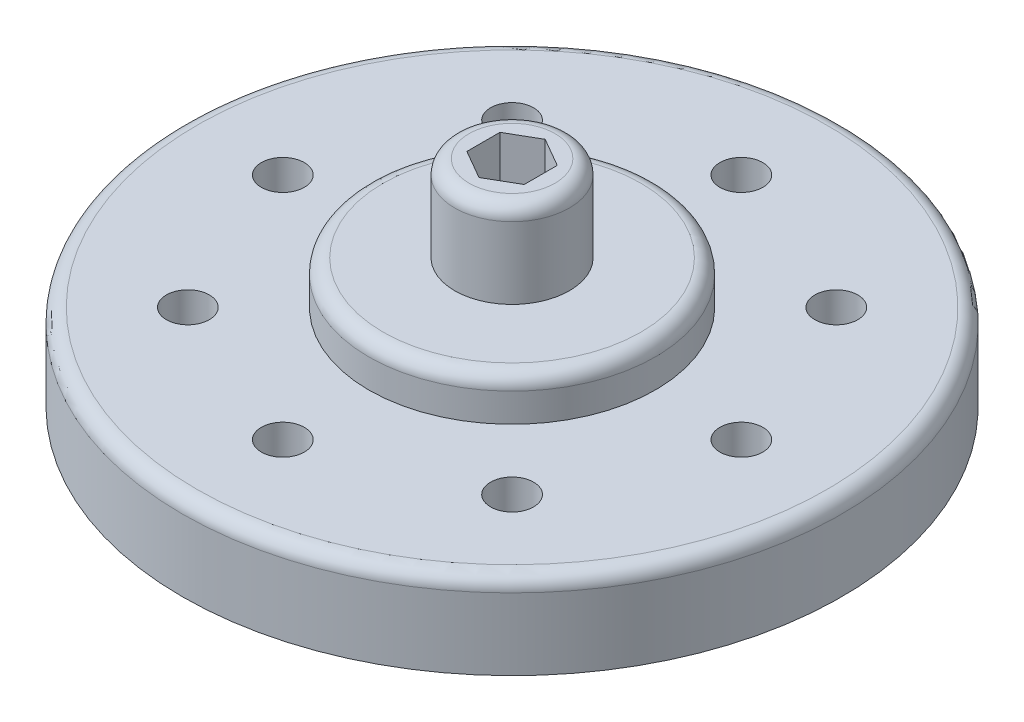
ISO-10303-21;
HEADER;
FILE_DESCRIPTION(('STEP AP214'),'2;1');
FILE_NAME('part.step','',(''),(''),'','','');
FILE_SCHEMA(('AUTOMOTIVE_DESIGN { 1 0 10303 214 1 1 1 1 }'));
ENDSEC;
DATA;
#1=APPLICATION_CONTEXT('core data for automotive mechanical design processes');
#2=APPLICATION_PROTOCOL_DEFINITION('international standard','automotive_design',2000,#1);
#3=PRODUCT_CONTEXT('',#1,'mechanical');
#4=PRODUCT('Part','Part','',(#3));
#5=PRODUCT_RELATED_PRODUCT_CATEGORY('part','',(#4));
#6=PRODUCT_DEFINITION_FORMATION('','',#4);
#7=PRODUCT_DEFINITION_CONTEXT('part definition',#1,'design');
#8=PRODUCT_DEFINITION('design','',#6,#7);
#9=PRODUCT_DEFINITION_SHAPE('','',#8);
#10=(LENGTH_UNIT() NAMED_UNIT(*) SI_UNIT(.MILLI.,.METRE.));
#11=(NAMED_UNIT(*) PLANE_ANGLE_UNIT() SI_UNIT($,.RADIAN.));
#12=(NAMED_UNIT(*) SI_UNIT($,.STERADIAN.) SOLID_ANGLE_UNIT());
#13=UNCERTAINTY_MEASURE_WITH_UNIT(LENGTH_MEASURE(1.E-05),#10,'distance_accuracy_value','');
#14=(GEOMETRIC_REPRESENTATION_CONTEXT(3) GLOBAL_UNCERTAINTY_ASSIGNED_CONTEXT((#13)) GLOBAL_UNIT_ASSIGNED_CONTEXT((#10,
#11,#12)) REPRESENTATION_CONTEXT('',''));
#15=CARTESIAN_POINT('',(0.,0.,0.));
#16=DIRECTION('',(0.,0.,1.));
#17=DIRECTION('',(1.,0.,0.));
#18=AXIS2_PLACEMENT_3D('',#15,#16,#17);
#19=CARTESIAN_POINT('',(0.,4.5,-13.3));
#20=DIRECTION('',(0.,1.,0.));
#21=DIRECTION('',(0.,0.,1.));
#22=AXIS2_PLACEMENT_3D('',#19,#20,#21);
#23=PLANE('',#22);
#24=CARTESIAN_POINT('',(0.,4.5,-13.3));
#25=DIRECTION('',(0.,1.,0.));
#26=DIRECTION('',(0.,0.,1.));
#27=AXIS2_PLACEMENT_3D('',#24,#25,#26);
#28=CIRCLE('',#27,4.5);
#29=CARTESIAN_POINT('',(0.,4.5,-8.79999999999999));
#30=VERTEX_POINT('',#29);
#31=EDGE_CURVE('E226',#30,#30,#28,.T.);
#32=ORIENTED_EDGE('',*,*,#31,.T.);
#33=EDGE_LOOP('',(#32));
#34=FACE_BOUND('',#33,.T.);
#35=CARTESIAN_POINT('',(0.,4.5,-13.3));
#36=DIRECTION('',(0.,1.,0.));
#37=DIRECTION('',(0.,0.,1.));
#38=AXIS2_PLACEMENT_3D('',#35,#36,#37);
#39=CIRCLE('',#38,2.);
#40=CARTESIAN_POINT('',(0.,4.5,-11.3));
#41=VERTEX_POINT('',#40);
#42=EDGE_CURVE('E156',#41,#41,#39,.T.);
#43=ORIENTED_EDGE('',*,*,#42,.F.);
#44=EDGE_LOOP('',(#43));
#45=FACE_BOUND('',#44,.T.);
#46=ADVANCED_FACE('F55',(#34,#45),#23,.T.);
#47=CARTESIAN_POINT('',(0.,3.,-13.3));
#48=DIRECTION('',(0.,1.,0.));
#49=DIRECTION('',(0.,0.,1.));
#50=AXIS2_PLACEMENT_3D('',#47,#48,#49);
#51=PLANE('',#50);
#52=CARTESIAN_POINT('',(0.,3.,-13.3));
#53=DIRECTION('',(0.,1.,0.));
#54=DIRECTION('',(0.,0.,1.));
#55=AXIS2_PLACEMENT_3D('',#52,#53,#54);
#56=CIRCLE('',#55,11.);
#57=CARTESIAN_POINT('',(0.,3.,-2.3));
#58=VERTEX_POINT('',#57);
#59=EDGE_CURVE('E232',#58,#58,#56,.T.);
#60=ORIENTED_EDGE('',*,*,#59,.T.);
#61=EDGE_LOOP('',(#60));
#62=FACE_BOUND('',#61,.T.);
#63=CARTESIAN_POINT('',(5.65685424949231,3.,-18.9568542494924));
#64=DIRECTION('',(0.,1.,0.));
#65=DIRECTION('',(-0.707106781186539,0.,0.707106781186556));
#66=AXIS2_PLACEMENT_3D('',#63,#64,#65);
#67=CIRCLE('',#66,0.750000000000001);
#68=CARTESIAN_POINT('',(5.1265241636024,3.,-18.4265241636025));
#69=VERTEX_POINT('',#68);
#70=EDGE_CURVE('E170',#69,#69,#67,.T.);
#71=ORIENTED_EDGE('',*,*,#70,.F.);
#72=EDGE_LOOP('',(#71));
#73=FACE_BOUND('',#72,.T.);
#74=CARTESIAN_POINT('',(5.65685424949243,3.,-7.64314575050767));
#75=DIRECTION('',(0.,1.,0.));
#76=DIRECTION('',(-0.707106781186554,0.,-0.707106781186541));
#77=AXIS2_PLACEMENT_3D('',#74,#75,#76);
#78=CIRCLE('',#77,0.750000000000001);
#79=CARTESIAN_POINT('',(5.12652416360252,3.,-8.17347583639758));
#80=VERTEX_POINT('',#79);
#81=EDGE_CURVE('E182',#80,#80,#78,.T.);
#82=ORIENTED_EDGE('',*,*,#81,.F.);
#83=EDGE_LOOP('',(#82));
#84=FACE_BOUND('',#83,.T.);
#85=CARTESIAN_POINT('',(-5.65685424949234,3.,-7.64314575050758));
#86=DIRECTION('',(0.,1.,0.));
#87=DIRECTION('',(0.707106781186544,0.,-0.707106781186551));
#88=AXIS2_PLACEMENT_3D('',#85,#86,#87);
#89=CIRCLE('',#88,0.750000000000001);
#90=CARTESIAN_POINT('',(-5.12652416360244,3.,-8.1734758363975));
#91=VERTEX_POINT('',#90);
#92=EDGE_CURVE('E194',#91,#91,#89,.T.);
#93=ORIENTED_EDGE('',*,*,#92,.F.);
#94=EDGE_LOOP('',(#93));
#95=FACE_BOUND('',#94,.T.);
#96=CARTESIAN_POINT('',(-5.65685424949239,3.,-18.9568542494924));
#97=DIRECTION('',(0.,1.,0.));
#98=DIRECTION('',(0.707106781186549,0.,0.707106781186546));
#99=AXIS2_PLACEMENT_3D('',#96,#97,#98);
#100=CIRCLE('',#99,0.750000000000001);
#101=CARTESIAN_POINT('',(-5.12652416360248,3.,-18.4265241636025));
#102=VERTEX_POINT('',#101);
#103=EDGE_CURVE('E206',#102,#102,#100,.T.);
#104=ORIENTED_EDGE('',*,*,#103,.F.);
#105=EDGE_LOOP('',(#104));
#106=FACE_BOUND('',#105,.T.);
#107=CARTESIAN_POINT('',(0.,3.,-21.3));
#108=DIRECTION('',(0.,1.,0.));
#109=DIRECTION('',(0.,0.,1.));
#110=AXIS2_PLACEMENT_3D('',#107,#108,#109);
#111=CIRCLE('',#110,0.750000000000001);
#112=CARTESIAN_POINT('',(0.,3.,-20.55));
#113=VERTEX_POINT('',#112);
#114=EDGE_CURVE('E212',#113,#113,#111,.T.);
#115=ORIENTED_EDGE('',*,*,#114,.F.);
#116=EDGE_LOOP('',(#115));
#117=FACE_BOUND('',#116,.T.);
#118=CARTESIAN_POINT('',(-7.99999999999999,3.,-13.3));
#119=DIRECTION('',(0.,1.,0.));
#120=DIRECTION('',(1.,0.,0.));
#121=AXIS2_PLACEMENT_3D('',#118,#119,#120);
#122=CIRCLE('',#121,0.750000000000001);
#123=CARTESIAN_POINT('',(-7.24999999999999,3.,-13.3));
#124=VERTEX_POINT('',#123);
#125=EDGE_CURVE('E200',#124,#124,#122,.T.);
#126=ORIENTED_EDGE('',*,*,#125,.F.);
#127=EDGE_LOOP('',(#126));
#128=FACE_BOUND('',#127,.T.);
#129=CARTESIAN_POINT('',(0.,3.,-5.3));
#130=DIRECTION('',(0.,1.,0.));
#131=DIRECTION('',(0.,0.,-1.));
#132=AXIS2_PLACEMENT_3D('',#129,#130,#131);
#133=CIRCLE('',#132,0.750000000000001);
#134=CARTESIAN_POINT('',(0.,3.,-6.05));
#135=VERTEX_POINT('',#134);
#136=EDGE_CURVE('E188',#135,#135,#133,.T.);
#137=ORIENTED_EDGE('',*,*,#136,.F.);
#138=EDGE_LOOP('',(#137));
#139=FACE_BOUND('',#138,.T.);
#140=CARTESIAN_POINT('',(8.,3.,-13.3000000000001));
#141=DIRECTION('',(0.,1.,0.));
#142=DIRECTION('',(-1.,0.,0.));
#143=AXIS2_PLACEMENT_3D('',#140,#141,#142);
#144=CIRCLE('',#143,0.750000000000001);
#145=CARTESIAN_POINT('',(7.25,3.,-13.3000000000001));
#146=VERTEX_POINT('',#145);
#147=EDGE_CURVE('E176',#146,#146,#144,.T.);
#148=ORIENTED_EDGE('',*,*,#147,.F.);
#149=EDGE_LOOP('',(#148));
#150=FACE_BOUND('',#149,.T.);
#151=CARTESIAN_POINT('',(0.,3.,-13.3));
#152=DIRECTION('',(0.,1.,0.));
#153=DIRECTION('',(0.,0.,1.));
#154=AXIS2_PLACEMENT_3D('',#151,#152,#153);
#155=CIRCLE('',#154,5.);
#156=CARTESIAN_POINT('',(0.,3.,-8.29999999999999));
#157=VERTEX_POINT('',#156);
#158=EDGE_CURVE('E166',#157,#157,#155,.T.);
#159=ORIENTED_EDGE('',*,*,#158,.F.);
#160=EDGE_LOOP('',(#159));
#161=FACE_BOUND('',#160,.T.);
#162=ADVANCED_FACE('F246',(#62,#73,#84,#95,#106,#117,#128,#139,#150,#161),#51,.T.);
#163=CARTESIAN_POINT('',(0.,0.,-13.3));
#164=DIRECTION('',(0.,1.,0.));
#165=DIRECTION('',(0.,0.,1.));
#166=AXIS2_PLACEMENT_3D('',#163,#164,#165);
#167=PLANE('',#166);
#168=CARTESIAN_POINT('',(0.,0.,-13.3));
#169=DIRECTION('',(0.,1.,0.));
#170=DIRECTION('',(0.,0.,1.));
#171=AXIS2_PLACEMENT_3D('',#168,#169,#170);
#172=CIRCLE('',#171,5.);
#173=CARTESIAN_POINT('',(0.,0.,-8.29999999999999));
#174=VERTEX_POINT('',#173);
#175=EDGE_CURVE('E132',#174,#174,#172,.T.);
#176=ORIENTED_EDGE('',*,*,#175,.T.);
#177=EDGE_LOOP('',(#176));
#178=FACE_BOUND('',#177,.T.);
#179=CARTESIAN_POINT('',(0.,0.,-13.3));
#180=DIRECTION('',(0.,1.,0.));
#181=DIRECTION('',(0.,0.,1.));
#182=AXIS2_PLACEMENT_3D('',#179,#180,#181);
#183=CIRCLE('',#182,11.5);
#184=CARTESIAN_POINT('',(0.,0.,-1.8));
#185=VERTEX_POINT('',#184);
#186=EDGE_CURVE('E215',#185,#185,#183,.T.);
#187=ORIENTED_EDGE('',*,*,#186,.F.);
#188=EDGE_LOOP('',(#187));
#189=FACE_BOUND('',#188,.T.);
#190=CARTESIAN_POINT('',(0.,0.,-21.3));
#191=DIRECTION('',(0.,1.,0.));
#192=DIRECTION('',(0.,0.,1.));
#193=AXIS2_PLACEMENT_3D('',#190,#191,#192);
#194=CIRCLE('',#193,0.750000000000001);
#195=CARTESIAN_POINT('',(0.,0.,-20.55));
#196=VERTEX_POINT('',#195);
#197=EDGE_CURVE('E209',#196,#196,#194,.T.);
#198=ORIENTED_EDGE('',*,*,#197,.T.);
#199=EDGE_LOOP('',(#198));
#200=FACE_BOUND('',#199,.T.);
#201=CARTESIAN_POINT('',(-5.65685424949239,0.,-18.9568542494924));
#202=DIRECTION('',(0.,1.,0.));
#203=DIRECTION('',(0.707106781186549,0.,0.707106781186546));
#204=AXIS2_PLACEMENT_3D('',#201,#202,#203);
#205=CIRCLE('',#204,0.750000000000001);
#206=CARTESIAN_POINT('',(-5.12652416360248,0.,-18.4265241636025));
#207=VERTEX_POINT('',#206);
#208=EDGE_CURVE('E203',#207,#207,#205,.T.);
#209=ORIENTED_EDGE('',*,*,#208,.T.);
#210=EDGE_LOOP('',(#209));
#211=FACE_BOUND('',#210,.T.);
#212=CARTESIAN_POINT('',(-7.99999999999999,0.,-13.3));
#213=DIRECTION('',(0.,1.,0.));
#214=DIRECTION('',(1.,0.,0.));
#215=AXIS2_PLACEMENT_3D('',#212,#213,#214);
#216=CIRCLE('',#215,0.750000000000001);
#217=CARTESIAN_POINT('',(-7.24999999999999,0.,-13.3));
#218=VERTEX_POINT('',#217);
#219=EDGE_CURVE('E197',#218,#218,#216,.T.);
#220=ORIENTED_EDGE('',*,*,#219,.T.);
#221=EDGE_LOOP('',(#220));
#222=FACE_BOUND('',#221,.T.);
#223=CARTESIAN_POINT('',(-5.65685424949234,0.,-7.64314575050758));
#224=DIRECTION('',(0.,1.,0.));
#225=DIRECTION('',(0.707106781186544,0.,-0.707106781186551));
#226=AXIS2_PLACEMENT_3D('',#223,#224,#225);
#227=CIRCLE('',#226,0.750000000000001);
#228=CARTESIAN_POINT('',(-5.12652416360244,0.,-8.1734758363975));
#229=VERTEX_POINT('',#228);
#230=EDGE_CURVE('E191',#229,#229,#227,.T.);
#231=ORIENTED_EDGE('',*,*,#230,.T.);
#232=EDGE_LOOP('',(#231));
#233=FACE_BOUND('',#232,.T.);
#234=CARTESIAN_POINT('',(0.,0.,-5.3));
#235=DIRECTION('',(0.,1.,0.));
#236=DIRECTION('',(0.,0.,-1.));
#237=AXIS2_PLACEMENT_3D('',#234,#235,#236);
#238=CIRCLE('',#237,0.750000000000001);
#239=CARTESIAN_POINT('',(0.,0.,-6.05));
#240=VERTEX_POINT('',#239);
#241=EDGE_CURVE('E185',#240,#240,#238,.T.);
#242=ORIENTED_EDGE('',*,*,#241,.T.);
#243=EDGE_LOOP('',(#242));
#244=FACE_BOUND('',#243,.T.);
#245=CARTESIAN_POINT('',(5.65685424949243,0.,-7.64314575050767));
#246=DIRECTION('',(0.,1.,0.));
#247=DIRECTION('',(-0.707106781186554,0.,-0.707106781186541));
#248=AXIS2_PLACEMENT_3D('',#245,#246,#247);
#249=CIRCLE('',#248,0.750000000000001);
#250=CARTESIAN_POINT('',(5.12652416360252,0.,-8.17347583639758));
#251=VERTEX_POINT('',#250);
#252=EDGE_CURVE('E179',#251,#251,#249,.T.);
#253=ORIENTED_EDGE('',*,*,#252,.T.);
#254=EDGE_LOOP('',(#253));
#255=FACE_BOUND('',#254,.T.);
#256=CARTESIAN_POINT('',(8.,0.,-13.3000000000001));
#257=DIRECTION('',(0.,1.,0.));
#258=DIRECTION('',(-1.,0.,0.));
#259=AXIS2_PLACEMENT_3D('',#256,#257,#258);
#260=CIRCLE('',#259,0.750000000000001);
#261=CARTESIAN_POINT('',(7.25,0.,-13.3000000000001));
#262=VERTEX_POINT('',#261);
#263=EDGE_CURVE('E173',#262,#262,#260,.T.);
#264=ORIENTED_EDGE('',*,*,#263,.T.);
#265=EDGE_LOOP('',(#264));
#266=FACE_BOUND('',#265,.T.);
#267=CARTESIAN_POINT('',(5.65685424949231,0.,-18.9568542494924));
#268=DIRECTION('',(0.,1.,0.));
#269=DIRECTION('',(-0.707106781186539,0.,0.707106781186556));
#270=AXIS2_PLACEMENT_3D('',#267,#268,#269);
#271=CIRCLE('',#270,0.750000000000001);
#272=CARTESIAN_POINT('',(5.1265241636024,0.,-18.4265241636025));
#273=VERTEX_POINT('',#272);
#274=EDGE_CURVE('E169',#273,#273,#271,.T.);
#275=ORIENTED_EDGE('',*,*,#274,.T.);
#276=EDGE_LOOP('',(#275));
#277=FACE_BOUND('',#276,.T.);
#278=ADVANCED_FACE('F249',(#178,#189,#200,#211,#222,#233,#244,#255,#266,#277),#167,.F.);
#279=CARTESIAN_POINT('',(0.,3.,-13.3));
#280=DIRECTION('',(0.,-1.,0.));
#281=DIRECTION('',(0.,0.,-1.));
#282=AXIS2_PLACEMENT_3D('',#279,#280,#281);
#283=CYLINDRICAL_SURFACE('',#282,11.5);
#284=CARTESIAN_POINT('',(0.,2.5,-13.3));
#285=DIRECTION('',(0.,1.,0.));
#286=DIRECTION('',(0.,0.,1.));
#287=AXIS2_PLACEMENT_3D('',#284,#285,#286);
#288=CIRCLE('',#287,11.5);
#289=CARTESIAN_POINT('',(0.,2.5,-1.8));
#290=VERTEX_POINT('',#289);
#291=EDGE_CURVE('E63',#290,#290,#288,.F.);
#292=ORIENTED_EDGE('',*,*,#291,.T.);
#293=EDGE_LOOP('',(#292));
#294=FACE_BOUND('',#293,.T.);
#295=ORIENTED_EDGE('',*,*,#186,.T.);
#296=EDGE_LOOP('',(#295));
#297=FACE_BOUND('',#296,.T.);
#298=ADVANCED_FACE('F237',(#294,#297),#283,.T.);
#299=CARTESIAN_POINT('',(0.,3.,-21.3));
#300=DIRECTION('',(0.,-1.,0.));
#301=DIRECTION('',(0.,0.,-1.));
#302=AXIS2_PLACEMENT_3D('',#299,#300,#301);
#303=CYLINDRICAL_SURFACE('',#302,0.750000000000001);
#304=ORIENTED_EDGE('',*,*,#114,.T.);
#305=EDGE_LOOP('',(#304));
#306=FACE_BOUND('',#305,.T.);
#307=ORIENTED_EDGE('',*,*,#197,.F.);
#308=EDGE_LOOP('',(#307));
#309=FACE_BOUND('',#308,.T.);
#310=ADVANCED_FACE('F400',(#306,#309),#303,.F.);
#311=CARTESIAN_POINT('',(-5.65685424949239,3.,-18.9568542494924));
#312=DIRECTION('',(0.,-1.,0.));
#313=DIRECTION('',(0.,0.,-1.));
#314=AXIS2_PLACEMENT_3D('',#311,#312,#313);
#315=CYLINDRICAL_SURFACE('',#314,0.750000000000001);
#316=ORIENTED_EDGE('',*,*,#103,.T.);
#317=EDGE_LOOP('',(#316));
#318=FACE_BOUND('',#317,.T.);
#319=ORIENTED_EDGE('',*,*,#208,.F.);
#320=EDGE_LOOP('',(#319));
#321=FACE_BOUND('',#320,.T.);
#322=ADVANCED_FACE('F420',(#318,#321),#315,.F.);
#323=CARTESIAN_POINT('',(-7.99999999999999,3.,-13.3));
#324=DIRECTION('',(0.,-1.,0.));
#325=DIRECTION('',(0.,0.,-1.));
#326=AXIS2_PLACEMENT_3D('',#323,#324,#325);
#327=CYLINDRICAL_SURFACE('',#326,0.750000000000001);
#328=ORIENTED_EDGE('',*,*,#125,.T.);
#329=EDGE_LOOP('',(#328));
#330=FACE_BOUND('',#329,.T.);
#331=ORIENTED_EDGE('',*,*,#219,.F.);
#332=EDGE_LOOP('',(#331));
#333=FACE_BOUND('',#332,.T.);
#334=ADVANCED_FACE('F427',(#330,#333),#327,.F.);
#335=CARTESIAN_POINT('',(-5.65685424949234,3.,-7.64314575050758));
#336=DIRECTION('',(0.,-1.,0.));
#337=DIRECTION('',(0.,0.,-1.));
#338=AXIS2_PLACEMENT_3D('',#335,#336,#337);
#339=CYLINDRICAL_SURFACE('',#338,0.750000000000001);
#340=ORIENTED_EDGE('',*,*,#92,.T.);
#341=EDGE_LOOP('',(#340));
#342=FACE_BOUND('',#341,.T.);
#343=ORIENTED_EDGE('',*,*,#230,.F.);
#344=EDGE_LOOP('',(#343));
#345=FACE_BOUND('',#344,.T.);
#346=ADVANCED_FACE('F435',(#342,#345),#339,.F.);
#347=CARTESIAN_POINT('',(0.,3.,-5.3));
#348=DIRECTION('',(0.,-1.,0.));
#349=DIRECTION('',(0.,0.,-1.));
#350=AXIS2_PLACEMENT_3D('',#347,#348,#349);
#351=CYLINDRICAL_SURFACE('',#350,0.750000000000001);
#352=ORIENTED_EDGE('',*,*,#136,.T.);
#353=EDGE_LOOP('',(#352));
#354=FACE_BOUND('',#353,.T.);
#355=ORIENTED_EDGE('',*,*,#241,.F.);
#356=EDGE_LOOP('',(#355));
#357=FACE_BOUND('',#356,.T.);
#358=ADVANCED_FACE('F443',(#354,#357),#351,.F.);
#359=CARTESIAN_POINT('',(5.65685424949243,3.,-7.64314575050767));
#360=DIRECTION('',(0.,-1.,0.));
#361=DIRECTION('',(0.,0.,-1.));
#362=AXIS2_PLACEMENT_3D('',#359,#360,#361);
#363=CYLINDRICAL_SURFACE('',#362,0.750000000000001);
#364=ORIENTED_EDGE('',*,*,#81,.T.);
#365=EDGE_LOOP('',(#364));
#366=FACE_BOUND('',#365,.T.);
#367=ORIENTED_EDGE('',*,*,#252,.F.);
#368=EDGE_LOOP('',(#367));
#369=FACE_BOUND('',#368,.T.);
#370=ADVANCED_FACE('F451',(#366,#369),#363,.F.);
#371=CARTESIAN_POINT('',(8.,3.,-13.3000000000001));
#372=DIRECTION('',(0.,-1.,0.));
#373=DIRECTION('',(0.,0.,-1.));
#374=AXIS2_PLACEMENT_3D('',#371,#372,#373);
#375=CYLINDRICAL_SURFACE('',#374,0.750000000000001);
#376=ORIENTED_EDGE('',*,*,#147,.T.);
#377=EDGE_LOOP('',(#376));
#378=FACE_BOUND('',#377,.T.);
#379=ORIENTED_EDGE('',*,*,#263,.F.);
#380=EDGE_LOOP('',(#379));
#381=FACE_BOUND('',#380,.T.);
#382=ADVANCED_FACE('F281',(#378,#381),#375,.F.);
#383=CARTESIAN_POINT('',(5.65685424949231,3.,-18.9568542494924));
#384=DIRECTION('',(0.,-1.,0.));
#385=DIRECTION('',(0.,0.,-1.));
#386=AXIS2_PLACEMENT_3D('',#383,#384,#385);
#387=CYLINDRICAL_SURFACE('',#386,0.750000000000001);
#388=ORIENTED_EDGE('',*,*,#70,.T.);
#389=EDGE_LOOP('',(#388));
#390=FACE_BOUND('',#389,.T.);
#391=ORIENTED_EDGE('',*,*,#274,.F.);
#392=EDGE_LOOP('',(#391));
#393=FACE_BOUND('',#392,.T.);
#394=ADVANCED_FACE('F272',(#390,#393),#387,.F.);
#395=CARTESIAN_POINT('',(0.,4.5,-13.3));
#396=DIRECTION('',(0.,-1.,0.));
#397=DIRECTION('',(0.,0.,-1.));
#398=AXIS2_PLACEMENT_3D('',#395,#396,#397);
#399=CYLINDRICAL_SURFACE('',#398,5.);
#400=CARTESIAN_POINT('',(0.,4.,-13.3));
#401=DIRECTION('',(0.,1.,0.));
#402=DIRECTION('',(0.,0.,1.));
#403=AXIS2_PLACEMENT_3D('',#400,#401,#402);
#404=CIRCLE('',#403,5.);
#405=CARTESIAN_POINT('',(0.,4.,-8.29999999999999));
#406=VERTEX_POINT('',#405);
#407=EDGE_CURVE('E229',#406,#406,#404,.F.);
#408=ORIENTED_EDGE('',*,*,#407,.T.);
#409=EDGE_LOOP('',(#408));
#410=FACE_BOUND('',#409,.T.);
#411=ORIENTED_EDGE('',*,*,#158,.T.);
#412=EDGE_LOOP('',(#411));
#413=FACE_BOUND('',#412,.T.);
#414=ADVANCED_FACE('F269',(#410,#413),#399,.T.);
#415=CARTESIAN_POINT('',(0.,7.5,-13.3));
#416=DIRECTION('',(0.,-1.,0.));
#417=DIRECTION('',(0.,0.,-1.));
#418=AXIS2_PLACEMENT_3D('',#415,#416,#417);
#419=CYLINDRICAL_SURFACE('',#418,2.);
#420=CARTESIAN_POINT('',(0.,7.,-13.3));
#421=DIRECTION('',(0.,1.,0.));
#422=DIRECTION('',(0.,0.,1.));
#423=AXIS2_PLACEMENT_3D('',#420,#421,#422);
#424=CIRCLE('',#423,2.);
#425=CARTESIAN_POINT('',(0.,7.,-11.3));
#426=VERTEX_POINT('',#425);
#427=EDGE_CURVE('E223',#426,#426,#424,.F.);
#428=ORIENTED_EDGE('',*,*,#427,.T.);
#429=EDGE_LOOP('',(#428));
#430=FACE_BOUND('',#429,.T.);
#431=ORIENTED_EDGE('',*,*,#42,.T.);
#432=EDGE_LOOP('',(#431));
#433=FACE_BOUND('',#432,.T.);
#434=ADVANCED_FACE('F271',(#430,#433),#419,.T.);
#435=CARTESIAN_POINT('',(0.,7.5,-13.3));
#436=DIRECTION('',(0.,1.,0.));
#437=DIRECTION('',(0.,0.,1.));
#438=AXIS2_PLACEMENT_3D('',#435,#436,#437);
#439=PLANE('',#438);
#440=CARTESIAN_POINT('',(0.,7.5,-13.3));
#441=DIRECTION('',(0.,1.,0.));
#442=DIRECTION('',(0.,0.,1.));
#443=AXIS2_PLACEMENT_3D('',#440,#441,#442);
#444=CIRCLE('',#443,1.5);
#445=CARTESIAN_POINT('',(0.,7.5,-11.8));
#446=VERTEX_POINT('',#445);
#447=EDGE_CURVE('E220',#446,#446,#444,.T.);
#448=ORIENTED_EDGE('',*,*,#447,.T.);
#449=EDGE_LOOP('',(#448));
#450=FACE_BOUND('',#449,.T.);
#451=DIRECTION('',(0.,0.,1.));
#452=VECTOR('',#451,1.);
#453=CARTESIAN_POINT('',(1.00000000000001,7.5,-13.3));
#454=LINE('',#453,#452);
#455=CARTESIAN_POINT('',(1.00000000000001,7.5,-13.8773502691896));
#456=VERTEX_POINT('',#455);
#457=CARTESIAN_POINT('',(1.00000000000001,7.5,-12.7226497308104));
#458=VERTEX_POINT('',#457);
#459=EDGE_CURVE('E110',#456,#458,#454,.T.);
#460=ORIENTED_EDGE('',*,*,#459,.T.);
#461=DIRECTION('',(-0.866025403784439,0.,0.5));
#462=VECTOR('',#461,1.);
#463=CARTESIAN_POINT('',(0.500000000000003,7.5,-12.4339745962156));
#464=LINE('',#463,#462);
#465=CARTESIAN_POINT('',(0.,7.5,-12.1452994616207));
#466=VERTEX_POINT('',#465);
#467=EDGE_CURVE('E119',#458,#466,#464,.T.);
#468=ORIENTED_EDGE('',*,*,#467,.T.);
#469=DIRECTION('',(-0.866025403784439,0.,-0.5));
#470=VECTOR('',#469,1.);
#471=CARTESIAN_POINT('',(-0.499999999999997,7.5,-12.4339745962156));
#472=LINE('',#471,#470);
#473=CARTESIAN_POINT('',(-1.00000000000001,7.5,-12.7226497308104));
#474=VERTEX_POINT('',#473);
#475=EDGE_CURVE('E78',#466,#474,#472,.T.);
#476=ORIENTED_EDGE('',*,*,#475,.T.);
#477=DIRECTION('',(0.,0.,-1.));
#478=VECTOR('',#477,1.);
#479=CARTESIAN_POINT('',(-1.00000000000001,7.5,-13.3));
#480=LINE('',#479,#478);
#481=CARTESIAN_POINT('',(-1.00000000000001,7.5,-13.8773502691896));
#482=VERTEX_POINT('',#481);
#483=EDGE_CURVE('E136',#474,#482,#480,.T.);
#484=ORIENTED_EDGE('',*,*,#483,.T.);
#485=DIRECTION('',(0.866025403784439,0.,-0.5));
#486=VECTOR('',#485,1.);
#487=CARTESIAN_POINT('',(-0.500000000000002,7.5,-14.1660254037844));
#488=LINE('',#487,#486);
#489=CARTESIAN_POINT('',(0.,7.5,-14.4547005383793));
#490=VERTEX_POINT('',#489);
#491=EDGE_CURVE('E139',#482,#490,#488,.T.);
#492=ORIENTED_EDGE('',*,*,#491,.T.);
#493=DIRECTION('',(0.866025403784439,0.,0.5));
#494=VECTOR('',#493,1.);
#495=CARTESIAN_POINT('',(0.500000000000004,7.5,-14.1660254037844));
#496=LINE('',#495,#494);
#497=EDGE_CURVE('E116',#490,#456,#496,.T.);
#498=ORIENTED_EDGE('',*,*,#497,.T.);
#499=EDGE_LOOP('',(#460,#468,#476,#484,#492,#498));
#500=FACE_BOUND('',#499,.T.);
#501=ADVANCED_FACE('F123',(#450,#500),#439,.T.);
#502=CARTESIAN_POINT('',(1.00000000000001,7.5,-13.3));
#503=DIRECTION('',(1.,0.,0.));
#504=DIRECTION('',(0.,0.,-1.));
#505=AXIS2_PLACEMENT_3D('',#502,#503,#504);
#506=PLANE('',#505);
#507=DIRECTION('',(0.,0.,1.));
#508=VECTOR('',#507,1.);
#509=CARTESIAN_POINT('',(1.00000000000001,4.5,-13.3));
#510=LINE('',#509,#508);
#511=CARTESIAN_POINT('',(1.00000000000001,4.5,-13.8773502691896));
#512=VERTEX_POINT('',#511);
#513=CARTESIAN_POINT('',(1.00000000000001,4.5,-12.7226497308104));
#514=VERTEX_POINT('',#513);
#515=EDGE_CURVE('E113',#512,#514,#510,.T.);
#516=ORIENTED_EDGE('',*,*,#515,.T.);
#517=DIRECTION('',(0.,-1.,0.));
#518=VECTOR('',#517,1.);
#519=CARTESIAN_POINT('',(1.00000000000001,7.5,-12.7226497308104));
#520=LINE('',#519,#518);
#521=EDGE_CURVE('E70',#458,#514,#520,.T.);
#522=ORIENTED_EDGE('',*,*,#521,.F.);
#523=ORIENTED_EDGE('',*,*,#459,.F.);
#524=DIRECTION('',(0.,-1.,0.));
#525=VECTOR('',#524,1.);
#526=CARTESIAN_POINT('',(1.00000000000001,7.5,-13.8773502691896));
#527=LINE('',#526,#525);
#528=EDGE_CURVE('E154',#456,#512,#527,.T.);
#529=ORIENTED_EDGE('',*,*,#528,.T.);
#530=EDGE_LOOP('',(#516,#522,#523,#529));
#531=FACE_BOUND('',#530,.T.);
#532=ADVANCED_FACE('F108',(#531),#506,.F.);
#533=CARTESIAN_POINT('',(0.500000000000004,7.5,-14.1660254037844));
#534=DIRECTION('',(0.5,0.,-0.866025403784439));
#535=DIRECTION('',(-0.866025403784439,0.,-0.5));
#536=AXIS2_PLACEMENT_3D('',#533,#534,#535);
#537=PLANE('',#536);
#538=DIRECTION('',(0.866025403784439,0.,0.5));
#539=VECTOR('',#538,1.);
#540=CARTESIAN_POINT('',(0.500000000000004,4.5,-14.1660254037844));
#541=LINE('',#540,#539);
#542=CARTESIAN_POINT('',(0.,4.5,-14.4547005383793));
#543=VERTEX_POINT('',#542);
#544=EDGE_CURVE('E126',#543,#512,#541,.T.);
#545=ORIENTED_EDGE('',*,*,#544,.T.);
#546=ORIENTED_EDGE('',*,*,#528,.F.);
#547=ORIENTED_EDGE('',*,*,#497,.F.);
#548=DIRECTION('',(0.,-1.,0.));
#549=VECTOR('',#548,1.);
#550=CARTESIAN_POINT('',(0.,7.5,-14.4547005383793));
#551=LINE('',#550,#549);
#552=EDGE_CURVE('E157',#490,#543,#551,.T.);
#553=ORIENTED_EDGE('',*,*,#552,.T.);
#554=EDGE_LOOP('',(#545,#546,#547,#553));
#555=FACE_BOUND('',#554,.T.);
#556=ADVANCED_FACE('F313',(#555),#537,.F.);
#557=CARTESIAN_POINT('',(-0.500000000000002,7.5,-14.1660254037844));
#558=DIRECTION('',(-0.5,0.,-0.866025403784438));
#559=DIRECTION('',(-0.866025403784439,0.,0.5));
#560=AXIS2_PLACEMENT_3D('',#557,#558,#559);
#561=PLANE('',#560);
#562=DIRECTION('',(0.866025403784439,0.,-0.5));
#563=VECTOR('',#562,1.);
#564=CARTESIAN_POINT('',(-0.500000000000002,4.5,-14.1660254037844));
#565=LINE('',#564,#563);
#566=CARTESIAN_POINT('',(-1.00000000000001,4.5,-13.8773502691896));
#567=VERTEX_POINT('',#566);
#568=EDGE_CURVE('E129',#567,#543,#565,.T.);
#569=ORIENTED_EDGE('',*,*,#568,.T.);
#570=ORIENTED_EDGE('',*,*,#552,.F.);
#571=ORIENTED_EDGE('',*,*,#491,.F.);
#572=DIRECTION('',(0.,-1.,0.));
#573=VECTOR('',#572,1.);
#574=CARTESIAN_POINT('',(-1.00000000000001,7.5,-13.8773502691896));
#575=LINE('',#574,#573);
#576=EDGE_CURVE('E159',#482,#567,#575,.T.);
#577=ORIENTED_EDGE('',*,*,#576,.T.);
#578=EDGE_LOOP('',(#569,#570,#571,#577));
#579=FACE_BOUND('',#578,.T.);
#580=ADVANCED_FACE('F311',(#579),#561,.F.);
#581=CARTESIAN_POINT('',(-1.00000000000001,7.5,-13.3));
#582=DIRECTION('',(-1.,0.,0.));
#583=DIRECTION('',(0.,0.,1.));
#584=AXIS2_PLACEMENT_3D('',#581,#582,#583);
#585=PLANE('',#584);
#586=DIRECTION('',(0.,0.,-1.));
#587=VECTOR('',#586,1.);
#588=CARTESIAN_POINT('',(-1.00000000000001,4.5,-13.3));
#589=LINE('',#588,#587);
#590=CARTESIAN_POINT('',(-1.00000000000001,4.5,-12.7226497308104));
#591=VERTEX_POINT('',#590);
#592=EDGE_CURVE('E149',#591,#567,#589,.T.);
#593=ORIENTED_EDGE('',*,*,#592,.T.);
#594=ORIENTED_EDGE('',*,*,#576,.F.);
#595=ORIENTED_EDGE('',*,*,#483,.F.);
#596=DIRECTION('',(0.,-1.,0.));
#597=VECTOR('',#596,1.);
#598=CARTESIAN_POINT('',(-1.00000000000001,7.5,-12.7226497308104));
#599=LINE('',#598,#597);
#600=EDGE_CURVE('E161',#474,#591,#599,.T.);
#601=ORIENTED_EDGE('',*,*,#600,.T.);
#602=EDGE_LOOP('',(#593,#594,#595,#601));
#603=FACE_BOUND('',#602,.T.);
#604=ADVANCED_FACE('F308',(#603),#585,.F.);
#605=CARTESIAN_POINT('',(-0.499999999999997,7.5,-12.4339745962156));
#606=DIRECTION('',(-0.499999999999999,0.,0.866025403784439));
#607=DIRECTION('',(0.866025403784439,0.,0.499999999999999));
#608=AXIS2_PLACEMENT_3D('',#605,#606,#607);
#609=PLANE('',#608);
#610=DIRECTION('',(-0.866025403784439,0.,-0.5));
#611=VECTOR('',#610,1.);
#612=CARTESIAN_POINT('',(-0.499999999999997,4.5,-12.4339745962156));
#613=LINE('',#612,#611);
#614=CARTESIAN_POINT('',(0.,4.5,-12.1452994616207));
#615=VERTEX_POINT('',#614);
#616=EDGE_CURVE('E146',#615,#591,#613,.T.);
#617=ORIENTED_EDGE('',*,*,#616,.T.);
#618=ORIENTED_EDGE('',*,*,#600,.F.);
#619=ORIENTED_EDGE('',*,*,#475,.F.);
#620=DIRECTION('',(0.,-1.,0.));
#621=VECTOR('',#620,1.);
#622=CARTESIAN_POINT('',(0.,7.5,-12.1452994616207));
#623=LINE('',#622,#621);
#624=EDGE_CURVE('E115',#466,#615,#623,.T.);
#625=ORIENTED_EDGE('',*,*,#624,.T.);
#626=EDGE_LOOP('',(#617,#618,#619,#625));
#627=FACE_BOUND('',#626,.T.);
#628=ADVANCED_FACE('F300',(#627),#609,.F.);
#629=CARTESIAN_POINT('',(0.500000000000003,7.5,-12.4339745962156));
#630=DIRECTION('',(0.5,0.,0.866025403784439));
#631=DIRECTION('',(0.866025403784439,0.,-0.5));
#632=AXIS2_PLACEMENT_3D('',#629,#630,#631);
#633=PLANE('',#632);
#634=DIRECTION('',(-0.866025403784439,0.,0.5));
#635=VECTOR('',#634,1.);
#636=CARTESIAN_POINT('',(0.500000000000003,4.5,-12.4339745962156));
#637=LINE('',#636,#635);
#638=EDGE_CURVE('E143',#514,#615,#637,.T.);
#639=ORIENTED_EDGE('',*,*,#638,.T.);
#640=ORIENTED_EDGE('',*,*,#624,.F.);
#641=ORIENTED_EDGE('',*,*,#467,.F.);
#642=ORIENTED_EDGE('',*,*,#521,.T.);
#643=EDGE_LOOP('',(#639,#640,#641,#642));
#644=FACE_BOUND('',#643,.T.);
#645=ADVANCED_FACE('F120',(#644),#633,.F.);
#646=ORIENTED_EDGE('',*,*,#638,.F.);
#647=ORIENTED_EDGE('',*,*,#515,.F.);
#648=ORIENTED_EDGE('',*,*,#544,.F.);
#649=ORIENTED_EDGE('',*,*,#568,.F.);
#650=ORIENTED_EDGE('',*,*,#592,.F.);
#651=ORIENTED_EDGE('',*,*,#616,.F.);
#652=EDGE_LOOP('',(#646,#647,#648,#649,#650,#651));
#653=FACE_BOUND('',#652,.T.);
#654=ADVANCED_FACE('F287',(#653),#23,.T.);
#655=CARTESIAN_POINT('',(0.,7.,-13.3));
#656=DIRECTION('',(0.,1.,0.));
#657=DIRECTION('',(0.,0.,1.));
#658=AXIS2_PLACEMENT_3D('',#655,#656,#657);
#659=TOROIDAL_SURFACE('',#658,1.5,0.5);
#660=ORIENTED_EDGE('',*,*,#427,.F.);
#661=EDGE_LOOP('',(#660));
#662=FACE_BOUND('',#661,.T.);
#663=ORIENTED_EDGE('',*,*,#447,.F.);
#664=EDGE_LOOP('',(#663));
#665=FACE_BOUND('',#664,.T.);
#666=ADVANCED_FACE('F292',(#662,#665),#659,.T.);
#667=CARTESIAN_POINT('',(0.,4.,-13.3));
#668=DIRECTION('',(0.,1.,0.));
#669=DIRECTION('',(0.,0.,1.));
#670=AXIS2_PLACEMENT_3D('',#667,#668,#669);
#671=TOROIDAL_SURFACE('',#670,4.5,0.5);
#672=ORIENTED_EDGE('',*,*,#407,.F.);
#673=EDGE_LOOP('',(#672));
#674=FACE_BOUND('',#673,.T.);
#675=ORIENTED_EDGE('',*,*,#31,.F.);
#676=EDGE_LOOP('',(#675));
#677=FACE_BOUND('',#676,.T.);
#678=ADVANCED_FACE('F243',(#674,#677),#671,.T.);
#679=CARTESIAN_POINT('',(0.,2.5,-13.3));
#680=DIRECTION('',(0.,1.,0.));
#681=DIRECTION('',(0.,0.,1.));
#682=AXIS2_PLACEMENT_3D('',#679,#680,#681);
#683=TOROIDAL_SURFACE('',#682,11.,0.5);
#684=ORIENTED_EDGE('',*,*,#291,.F.);
#685=EDGE_LOOP('',(#684));
#686=FACE_BOUND('',#685,.T.);
#687=ORIENTED_EDGE('',*,*,#59,.F.);
#688=EDGE_LOOP('',(#687));
#689=FACE_BOUND('',#688,.T.);
#690=ADVANCED_FACE('F57',(#686,#689),#683,.T.);
#691=CARTESIAN_POINT('',(0.,-1.,-13.3));
#692=DIRECTION('',(0.,1.,0.));
#693=DIRECTION('',(0.,0.,1.));
#694=AXIS2_PLACEMENT_3D('',#691,#692,#693);
#695=CYLINDRICAL_SURFACE('',#694,2.);
#696=CARTESIAN_POINT('',(0.,-1.,-13.3));
#697=DIRECTION('',(0.,1.,0.));
#698=DIRECTION('',(0.,0.,1.));
#699=AXIS2_PLACEMENT_3D('',#696,#697,#698);
#700=CIRCLE('',#699,2.);
#701=CARTESIAN_POINT('',(0.,-1.,-11.3));
#702=VERTEX_POINT('',#701);
#703=EDGE_CURVE('E553',#702,#702,#700,.T.);
#704=ORIENTED_EDGE('',*,*,#703,.F.);
#705=EDGE_LOOP('',(#704));
#706=FACE_BOUND('',#705,.T.);
#707=CARTESIAN_POINT('',(0.,0.,-13.3));
#708=DIRECTION('',(0.,1.,0.));
#709=DIRECTION('',(0.,0.,1.));
#710=AXIS2_PLACEMENT_3D('',#707,#708,#709);
#711=CIRCLE('',#710,2.);
#712=CARTESIAN_POINT('',(0.,0.,-11.3));
#713=VERTEX_POINT('',#712);
#714=EDGE_CURVE('E12',#713,#713,#711,.T.);
#715=ORIENTED_EDGE('',*,*,#714,.T.);
#716=EDGE_LOOP('',(#715));
#717=FACE_BOUND('',#716,.T.);
#718=ADVANCED_FACE('F242',(#706,#717),#695,.F.);
#719=CARTESIAN_POINT('',(0.,-1.,-13.3));
#720=DIRECTION('',(0.,1.,0.));
#721=DIRECTION('',(0.,0.,1.));
#722=AXIS2_PLACEMENT_3D('',#719,#720,#721);
#723=CYLINDRICAL_SURFACE('',#722,5.);
#724=CARTESIAN_POINT('',(0.,-1.,-13.3));
#725=DIRECTION('',(0.,1.,0.));
#726=DIRECTION('',(0.,0.,1.));
#727=AXIS2_PLACEMENT_3D('',#724,#725,#726);
#728=CIRCLE('',#727,5.);
#729=CARTESIAN_POINT('',(0.,-1.,-8.29999999999999));
#730=VERTEX_POINT('',#729);
#731=EDGE_CURVE('E144',#730,#730,#728,.T.);
#732=ORIENTED_EDGE('',*,*,#731,.T.);
#733=EDGE_LOOP('',(#732));
#734=FACE_BOUND('',#733,.T.);
#735=ORIENTED_EDGE('',*,*,#175,.F.);
#736=EDGE_LOOP('',(#735));
#737=FACE_BOUND('',#736,.T.);
#738=ADVANCED_FACE('F501',(#734,#737),#723,.T.);
#739=CARTESIAN_POINT('',(0.,-1.,0.));
#740=DIRECTION('',(0.,1.,0.));
#741=DIRECTION('',(0.,0.,1.));
#742=AXIS2_PLACEMENT_3D('',#739,#740,#741);
#743=PLANE('',#742);
#744=ORIENTED_EDGE('',*,*,#703,.T.);
#745=EDGE_LOOP('',(#744));
#746=FACE_BOUND('',#745,.T.);
#747=ORIENTED_EDGE('',*,*,#731,.F.);
#748=EDGE_LOOP('',(#747));
#749=FACE_BOUND('',#748,.T.);
#750=ADVANCED_FACE('F511',(#746,#749),#743,.F.);
#751=ORIENTED_EDGE('',*,*,#714,.F.);
#752=EDGE_LOOP('',(#751));
#753=FACE_BOUND('',#752,.T.);
#754=ADVANCED_FACE('F488',(#753),#167,.F.);
#755=CLOSED_SHELL('',(#46,#162,#278,#298,#310,#322,#334,#346,#358,#370,#382,#394,#414,#434,#501,
#532,#556,#580,#604,#628,#645,#654,#666,#678,#690,#718,#738,#750,#754));
#756=MANIFOLD_SOLID_BREP('B2',#755);
#757=ADVANCED_BREP_SHAPE_REPRESENTATION('',(#18,#756),#14);
#758=SHAPE_DEFINITION_REPRESENTATION(#9,#757);
ENDSEC;
END-ISO-10303-21;
